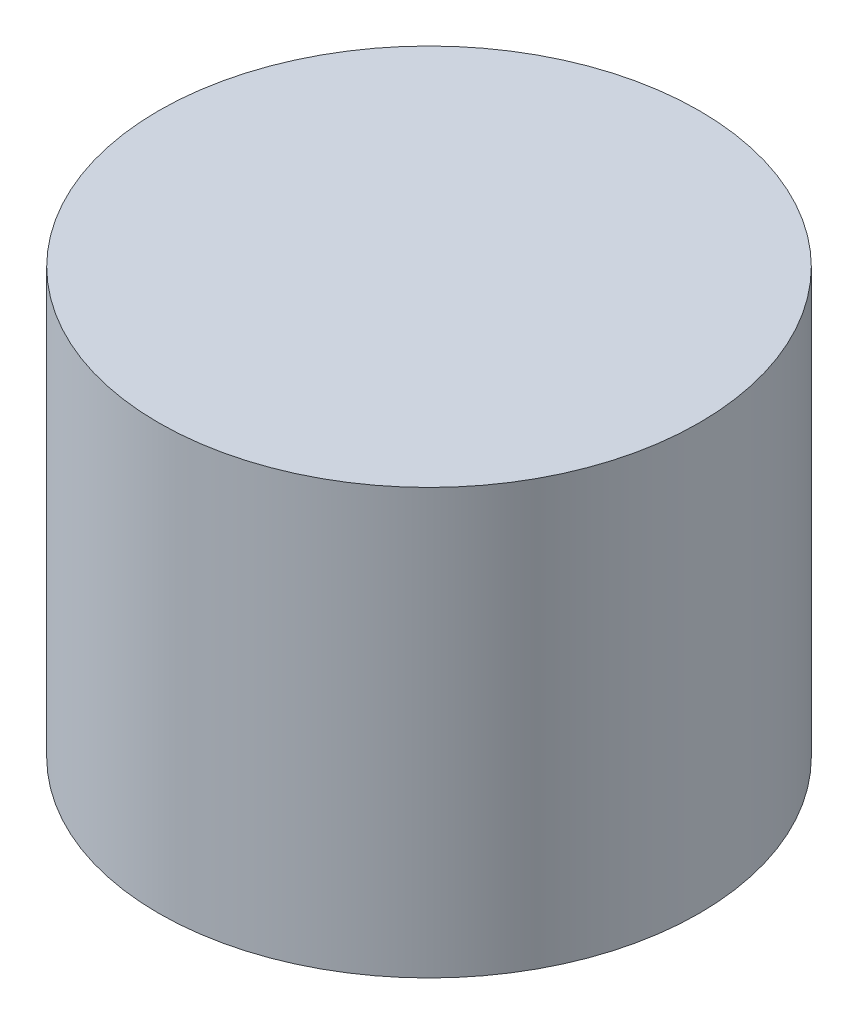
ISO-10303-21;
HEADER;
FILE_DESCRIPTION(('STEP AP214'),'2;1');
FILE_NAME('part.step','',(''),(''),'','','');
FILE_SCHEMA(('AUTOMOTIVE_DESIGN { 1 0 10303 214 1 1 1 1 }'));
ENDSEC;
DATA;
#1=APPLICATION_CONTEXT('core data for automotive mechanical design processes');
#2=APPLICATION_PROTOCOL_DEFINITION('international standard','automotive_design',2000,#1);
#3=PRODUCT_CONTEXT('',#1,'mechanical');
#4=PRODUCT('Part','Part','',(#3));
#5=PRODUCT_RELATED_PRODUCT_CATEGORY('part','',(#4));
#6=PRODUCT_DEFINITION_FORMATION('','',#4);
#7=PRODUCT_DEFINITION_CONTEXT('part definition',#1,'design');
#8=PRODUCT_DEFINITION('design','',#6,#7);
#9=PRODUCT_DEFINITION_SHAPE('','',#8);
#10=(LENGTH_UNIT() NAMED_UNIT(*) SI_UNIT(.MILLI.,.METRE.));
#11=(NAMED_UNIT(*) PLANE_ANGLE_UNIT() SI_UNIT($,.RADIAN.));
#12=(NAMED_UNIT(*) SI_UNIT($,.STERADIAN.) SOLID_ANGLE_UNIT());
#13=UNCERTAINTY_MEASURE_WITH_UNIT(LENGTH_MEASURE(1.E-05),#10,'distance_accuracy_value','');
#14=(GEOMETRIC_REPRESENTATION_CONTEXT(3) GLOBAL_UNCERTAINTY_ASSIGNED_CONTEXT((#13)) GLOBAL_UNIT_ASSIGNED_CONTEXT((#10,
#11,#12)) REPRESENTATION_CONTEXT('',''));
#15=CARTESIAN_POINT('',(0.,0.,0.));
#16=DIRECTION('',(0.,0.,1.));
#17=DIRECTION('',(1.,0.,0.));
#18=AXIS2_PLACEMENT_3D('',#15,#16,#17);
#19=CARTESIAN_POINT('',(0.,22.,0.));
#20=DIRECTION('',(0.,-1.,0.));
#21=DIRECTION('',(0.,0.,-1.));
#22=AXIS2_PLACEMENT_3D('',#19,#20,#21);
#23=CYLINDRICAL_SURFACE('',#22,14.);
#24=CARTESIAN_POINT('',(0.,22.,0.));
#25=DIRECTION('',(0.,1.,0.));
#26=DIRECTION('',(0.,0.,1.));
#27=AXIS2_PLACEMENT_3D('',#24,#25,#26);
#28=CIRCLE('',#27,14.);
#29=CARTESIAN_POINT('',(0.,22.,14.));
#30=VERTEX_POINT('',#29);
#31=EDGE_CURVE('E10',#30,#30,#28,.T.);
#32=ORIENTED_EDGE('',*,*,#31,.F.);
#33=EDGE_LOOP('',(#32));
#34=FACE_BOUND('',#33,.T.);
#35=CARTESIAN_POINT('',(0.,0.,0.));
#36=DIRECTION('',(0.,1.,0.));
#37=DIRECTION('',(0.,0.,1.));
#38=AXIS2_PLACEMENT_3D('',#35,#36,#37);
#39=CIRCLE('',#38,14.);
#40=CARTESIAN_POINT('',(0.,0.,14.));
#41=VERTEX_POINT('',#40);
#42=EDGE_CURVE('E40',#41,#41,#39,.T.);
#43=ORIENTED_EDGE('',*,*,#42,.T.);
#44=EDGE_LOOP('',(#43));
#45=FACE_BOUND('',#44,.T.);
#46=ADVANCED_FACE('F37',(#34,#45),#23,.T.);
#47=CARTESIAN_POINT('',(0.,22.,0.));
#48=DIRECTION('',(0.,1.,0.));
#49=DIRECTION('',(0.,0.,1.));
#50=AXIS2_PLACEMENT_3D('',#47,#48,#49);
#51=PLANE('',#50);
#52=ORIENTED_EDGE('',*,*,#31,.T.);
#53=EDGE_LOOP('',(#52));
#54=FACE_BOUND('',#53,.T.);
#55=ADVANCED_FACE('F54',(#54),#51,.T.);
#56=CARTESIAN_POINT('',(0.,0.,0.));
#57=DIRECTION('',(0.,1.,0.));
#58=DIRECTION('',(0.,0.,1.));
#59=AXIS2_PLACEMENT_3D('',#56,#57,#58);
#60=PLANE('',#59);
#61=ORIENTED_EDGE('',*,*,#42,.F.);
#62=EDGE_LOOP('',(#61));
#63=FACE_BOUND('',#62,.T.);
#64=ADVANCED_FACE('F52',(#63),#60,.F.);
#65=CLOSED_SHELL('',(#46,#55,#64));
#66=MANIFOLD_SOLID_BREP('B2',#65);
#67=ADVANCED_BREP_SHAPE_REPRESENTATION('',(#18,#66),#14);
#68=SHAPE_DEFINITION_REPRESENTATION(#9,#67);
ENDSEC;
END-ISO-10303-21;
